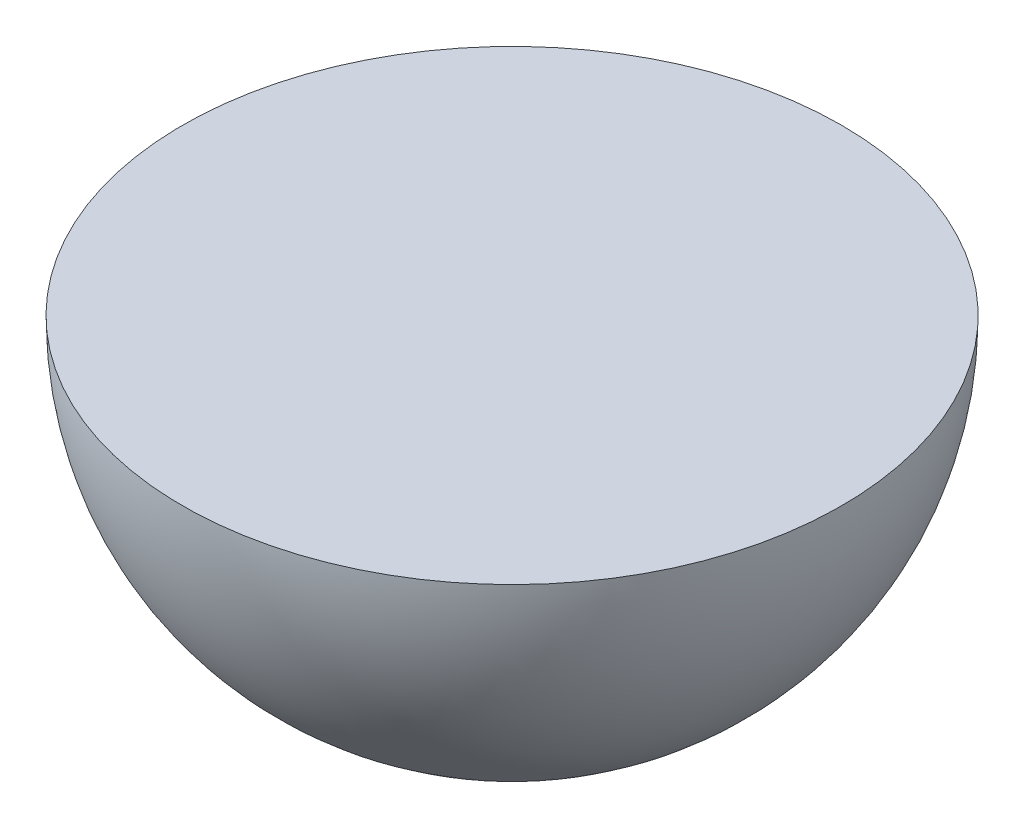
ISO-10303-21;
HEADER;
FILE_DESCRIPTION(('STEP AP214'),'2;1');
FILE_NAME('part.step','',(''),(''),'','','');
FILE_SCHEMA(('AUTOMOTIVE_DESIGN { 1 0 10303 214 1 1 1 1 }'));
ENDSEC;
DATA;
#1=APPLICATION_CONTEXT('core data for automotive mechanical design processes');
#2=APPLICATION_PROTOCOL_DEFINITION('international standard','automotive_design',2000,#1);
#3=PRODUCT_CONTEXT('',#1,'mechanical');
#4=PRODUCT('Part','Part','',(#3));
#5=PRODUCT_RELATED_PRODUCT_CATEGORY('part','',(#4));
#6=PRODUCT_DEFINITION_FORMATION('','',#4);
#7=PRODUCT_DEFINITION_CONTEXT('part definition',#1,'design');
#8=PRODUCT_DEFINITION('design','',#6,#7);
#9=PRODUCT_DEFINITION_SHAPE('','',#8);
#10=(LENGTH_UNIT() NAMED_UNIT(*) SI_UNIT(.MILLI.,.METRE.));
#11=(NAMED_UNIT(*) PLANE_ANGLE_UNIT() SI_UNIT($,.RADIAN.));
#12=(NAMED_UNIT(*) SI_UNIT($,.STERADIAN.) SOLID_ANGLE_UNIT());
#13=UNCERTAINTY_MEASURE_WITH_UNIT(LENGTH_MEASURE(1.E-05),#10,'distance_accuracy_value','');
#14=(GEOMETRIC_REPRESENTATION_CONTEXT(3) GLOBAL_UNCERTAINTY_ASSIGNED_CONTEXT((#13)) GLOBAL_UNIT_ASSIGNED_CONTEXT((#10,
#11,#12)) REPRESENTATION_CONTEXT('',''));
#15=CARTESIAN_POINT('',(0.,0.,0.));
#16=DIRECTION('',(0.,0.,1.));
#17=DIRECTION('',(1.,0.,0.));
#18=AXIS2_PLACEMENT_3D('',#15,#16,#17);
#19=CARTESIAN_POINT('',(0.,0.,0.));
#20=DIRECTION('',(1.,0.,0.));
#21=DIRECTION('',(0.,0.,-1.));
#22=AXIS2_PLACEMENT_3D('',#19,#20,#21);
#23=SPHERICAL_SURFACE('',#22,2.5);
#24=CARTESIAN_POINT('',(0.,0.,0.));
#25=DIRECTION('',(0.,-1.,0.));
#26=DIRECTION('',(0.,0.,-1.));
#27=AXIS2_PLACEMENT_3D('',#24,#25,#26);
#28=SPHERICAL_SURFACE('',#27,2.5);
#29=CARTESIAN_POINT('',(0.,0.,0.));
#30=DIRECTION('',(0.,-1.,0.));
#31=DIRECTION('',(0.,0.,-1.));
#32=AXIS2_PLACEMENT_3D('',#29,#30,#31);
#33=CIRCLE('',#32,2.5);
#34=CARTESIAN_POINT('',(0.,0.,-2.5));
#35=VERTEX_POINT('',#34);
#36=EDGE_CURVE('E10',#35,#35,#33,.T.);
#37=ORIENTED_EDGE('',*,*,#36,.T.);
#38=EDGE_LOOP('',(#37));
#39=FACE_BOUND('',#38,.T.);
#40=ADVANCED_FACE('F31',(#39),#28,.T.);
#41=CARTESIAN_POINT('',(0.,0.,0.));
#42=DIRECTION('',(0.,-1.,0.));
#43=DIRECTION('',(0.,0.,-1.));
#44=AXIS2_PLACEMENT_3D('',#41,#42,#43);
#45=PLANE('',#44);
#46=ORIENTED_EDGE('',*,*,#36,.F.);
#47=EDGE_LOOP('',(#46));
#48=FACE_BOUND('',#47,.T.);
#49=ADVANCED_FACE('F39',(#48),#45,.F.);
#50=CLOSED_SHELL('',(#40,#49));
#51=MANIFOLD_SOLID_BREP('B2',#50);
#52=ADVANCED_BREP_SHAPE_REPRESENTATION('',(#18,#51),#14);
#53=SHAPE_DEFINITION_REPRESENTATION(#9,#52);
ENDSEC;
END-ISO-10303-21;
